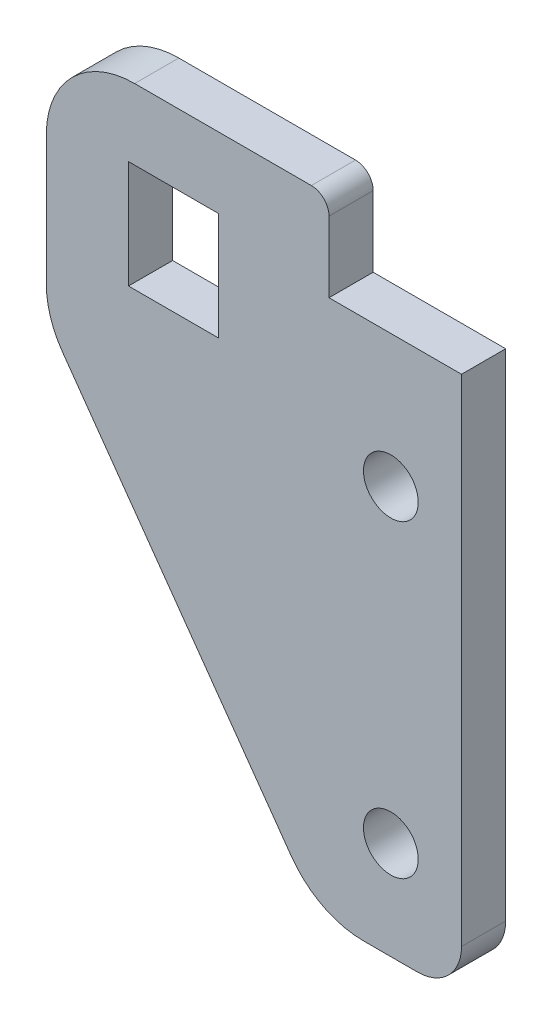
ISO-10303-21;
HEADER;
FILE_DESCRIPTION(('STEP AP214'),'2;1');
FILE_NAME('part.step','',(''),(''),'','','');
FILE_SCHEMA(('AUTOMOTIVE_DESIGN { 1 0 10303 214 1 1 1 1 }'));
ENDSEC;
DATA;
#1=APPLICATION_CONTEXT('core data for automotive mechanical design processes');
#2=APPLICATION_PROTOCOL_DEFINITION('international standard','automotive_design',2000,#1);
#3=PRODUCT_CONTEXT('',#1,'mechanical');
#4=PRODUCT('Part','Part','',(#3));
#5=PRODUCT_RELATED_PRODUCT_CATEGORY('part','',(#4));
#6=PRODUCT_DEFINITION_FORMATION('','',#4);
#7=PRODUCT_DEFINITION_CONTEXT('part definition',#1,'design');
#8=PRODUCT_DEFINITION('design','',#6,#7);
#9=PRODUCT_DEFINITION_SHAPE('','',#8);
#10=(LENGTH_UNIT() NAMED_UNIT(*) SI_UNIT(.MILLI.,.METRE.));
#11=(NAMED_UNIT(*) PLANE_ANGLE_UNIT() SI_UNIT($,.RADIAN.));
#12=(NAMED_UNIT(*) SI_UNIT($,.STERADIAN.) SOLID_ANGLE_UNIT());
#13=UNCERTAINTY_MEASURE_WITH_UNIT(LENGTH_MEASURE(1.E-05),#10,'distance_accuracy_value','');
#14=(GEOMETRIC_REPRESENTATION_CONTEXT(3) GLOBAL_UNCERTAINTY_ASSIGNED_CONTEXT((#13)) GLOBAL_UNIT_ASSIGNED_CONTEXT((#10,
#11,#12)) REPRESENTATION_CONTEXT('',''));
#15=CARTESIAN_POINT('',(0.,0.,0.));
#16=DIRECTION('',(0.,0.,1.));
#17=DIRECTION('',(1.,0.,0.));
#18=AXIS2_PLACEMENT_3D('',#15,#16,#17);
#19=CARTESIAN_POINT('',(0.,-77.1,5.));
#20=DIRECTION('',(0.,1.,0.));
#21=DIRECTION('',(0.,0.,1.));
#22=AXIS2_PLACEMENT_3D('',#19,#20,#21);
#23=PLANE('',#22);
#24=DIRECTION('',(1.,0.,0.));
#25=VECTOR('',#24,1.);
#26=CARTESIAN_POINT('',(0.,-77.1,0.));
#27=LINE('',#26,#25);
#28=CARTESIAN_POINT('',(-33.1025337448538,-77.1,0.));
#29=VERTEX_POINT('',#28);
#30=CARTESIAN_POINT('',(-27.,-77.1,0.));
#31=VERTEX_POINT('',#30);
#32=EDGE_CURVE('E267',#29,#31,#27,.T.);
#33=ORIENTED_EDGE('',*,*,#32,.T.);
#34=DIRECTION('',(0.,0.,-1.));
#35=VECTOR('',#34,1.);
#36=CARTESIAN_POINT('',(-27.,-77.1,5.));
#37=LINE('',#36,#35);
#38=CARTESIAN_POINT('',(-27.,-77.1,5.));
#39=VERTEX_POINT('',#38);
#40=EDGE_CURVE('E202',#31,#39,#37,.F.);
#41=ORIENTED_EDGE('',*,*,#40,.T.);
#42=DIRECTION('',(1.,0.,0.));
#43=VECTOR('',#42,1.);
#44=CARTESIAN_POINT('',(0.,-77.1,5.));
#45=LINE('',#44,#43);
#46=CARTESIAN_POINT('',(-33.1025337448538,-77.1,5.));
#47=VERTEX_POINT('',#46);
#48=EDGE_CURVE('E371',#47,#39,#45,.T.);
#49=ORIENTED_EDGE('',*,*,#48,.F.);
#50=DIRECTION('',(0.,0.,-1.));
#51=VECTOR('',#50,1.);
#52=CARTESIAN_POINT('',(-33.1025337448538,-77.1,5.));
#53=LINE('',#52,#51);
#54=EDGE_CURVE('E199',#47,#29,#53,.T.);
#55=ORIENTED_EDGE('',*,*,#54,.T.);
#56=EDGE_LOOP('',(#33,#41,#49,#55));
#57=FACE_BOUND('',#56,.T.);
#58=ADVANCED_FACE('F38',(#57),#23,.F.);
#59=CARTESIAN_POINT('',(-22.,0.,5.));
#60=DIRECTION('',(-1.,0.,0.));
#61=DIRECTION('',(0.,0.,1.));
#62=AXIS2_PLACEMENT_3D('',#59,#60,#61);
#63=PLANE('',#62);
#64=DIRECTION('',(0.,1.,0.));
#65=VECTOR('',#64,1.);
#66=CARTESIAN_POINT('',(-22.,0.,5.));
#67=LINE('',#66,#65);
#68=CARTESIAN_POINT('',(-22.,-72.1,5.));
#69=VERTEX_POINT('',#68);
#70=CARTESIAN_POINT('',(-22.,-16.,5.));
#71=VERTEX_POINT('',#70);
#72=EDGE_CURVE('E365',#69,#71,#67,.T.);
#73=ORIENTED_EDGE('',*,*,#72,.F.);
#74=DIRECTION('',(0.,0.,-1.));
#75=VECTOR('',#74,1.);
#76=CARTESIAN_POINT('',(-22.,-72.1,5.));
#77=LINE('',#76,#75);
#78=CARTESIAN_POINT('',(-22.,-72.1,0.));
#79=VERTEX_POINT('',#78);
#80=EDGE_CURVE('E186',#69,#79,#77,.T.);
#81=ORIENTED_EDGE('',*,*,#80,.T.);
#82=DIRECTION('',(0.,1.,0.));
#83=VECTOR('',#82,1.);
#84=CARTESIAN_POINT('',(-22.,0.,0.));
#85=LINE('',#84,#83);
#86=CARTESIAN_POINT('',(-22.,-16.,0.));
#87=VERTEX_POINT('',#86);
#88=EDGE_CURVE('E270',#79,#87,#85,.T.);
#89=ORIENTED_EDGE('',*,*,#88,.T.);
#90=DIRECTION('',(0.,0.,-1.));
#91=VECTOR('',#90,1.);
#92=CARTESIAN_POINT('',(-22.,-16.,5.));
#93=LINE('',#92,#91);
#94=EDGE_CURVE('E180',#71,#87,#93,.T.);
#95=ORIENTED_EDGE('',*,*,#94,.F.);
#96=EDGE_LOOP('',(#73,#81,#89,#95));
#97=FACE_BOUND('',#96,.T.);
#98=ADVANCED_FACE('F329',(#97),#63,.F.);
#99=CARTESIAN_POINT('',(0.,-16.,5.));
#100=DIRECTION('',(0.,-1.,0.));
#101=DIRECTION('',(1.,0.,0.));
#102=AXIS2_PLACEMENT_3D('',#99,#100,#101);
#103=PLANE('',#102);
#104=DIRECTION('',(-1.,0.,0.));
#105=VECTOR('',#104,1.);
#106=CARTESIAN_POINT('',(0.,-16.,0.));
#107=LINE('',#106,#105);
#108=CARTESIAN_POINT('',(-37.,-16.,0.));
#109=VERTEX_POINT('',#108);
#110=EDGE_CURVE('E275',#87,#109,#107,.T.);
#111=ORIENTED_EDGE('',*,*,#110,.T.);
#112=DIRECTION('',(0.,0.,-1.));
#113=VECTOR('',#112,1.);
#114=CARTESIAN_POINT('',(-37.,-16.,5.));
#115=LINE('',#114,#113);
#116=CARTESIAN_POINT('',(-37.,-16.,5.));
#117=VERTEX_POINT('',#116);
#118=EDGE_CURVE('E177',#117,#109,#115,.T.);
#119=ORIENTED_EDGE('',*,*,#118,.F.);
#120=DIRECTION('',(-1.,0.,0.));
#121=VECTOR('',#120,1.);
#122=CARTESIAN_POINT('',(0.,-16.,5.));
#123=LINE('',#122,#121);
#124=EDGE_CURVE('E299',#71,#117,#123,.T.);
#125=ORIENTED_EDGE('',*,*,#124,.F.);
#126=ORIENTED_EDGE('',*,*,#94,.T.);
#127=EDGE_LOOP('',(#111,#119,#125,#126));
#128=FACE_BOUND('',#127,.T.);
#129=ADVANCED_FACE('F335',(#128),#103,.F.);
#130=CARTESIAN_POINT('',(-37.,-1.04083408558608E-13,5.));
#131=DIRECTION('',(-1.,0.,0.));
#132=DIRECTION('',(0.,-1.,0.));
#133=AXIS2_PLACEMENT_3D('',#130,#131,#132);
#134=PLANE('',#133);
#135=DIRECTION('',(0.,1.,0.));
#136=VECTOR('',#135,1.);
#137=CARTESIAN_POINT('',(-37.,-1.04083408558608E-13,0.));
#138=LINE('',#137,#136);
#139=CARTESIAN_POINT('',(-37.,-8.00000000000001,0.));
#140=VERTEX_POINT('',#139);
#141=EDGE_CURVE('E246',#109,#140,#138,.T.);
#142=ORIENTED_EDGE('',*,*,#141,.T.);
#143=DIRECTION('',(0.,0.,-1.));
#144=VECTOR('',#143,1.);
#145=CARTESIAN_POINT('',(-37.,-8.00000000000001,5.));
#146=LINE('',#145,#144);
#147=CARTESIAN_POINT('',(-37.,-8.00000000000001,5.));
#148=VERTEX_POINT('',#147);
#149=EDGE_CURVE('E218',#140,#148,#146,.F.);
#150=ORIENTED_EDGE('',*,*,#149,.T.);
#151=DIRECTION('',(0.,1.,0.));
#152=VECTOR('',#151,1.);
#153=CARTESIAN_POINT('',(-37.,-1.04083408558608E-13,5.));
#154=LINE('',#153,#152);
#155=EDGE_CURVE('E293',#117,#148,#154,.T.);
#156=ORIENTED_EDGE('',*,*,#155,.F.);
#157=ORIENTED_EDGE('',*,*,#118,.T.);
#158=EDGE_LOOP('',(#142,#150,#156,#157));
#159=FACE_BOUND('',#158,.T.);
#160=ADVANCED_FACE('F280',(#159),#134,.F.);
#161=CARTESIAN_POINT('',(0.,-6.00000000000001,5.));
#162=DIRECTION('',(0.,-1.,0.));
#163=DIRECTION('',(1.,0.,0.));
#164=AXIS2_PLACEMENT_3D('',#161,#162,#163);
#165=PLANE('',#164);
#166=DIRECTION('',(-1.,0.,0.));
#167=VECTOR('',#166,1.);
#168=CARTESIAN_POINT('',(0.,-6.00000000000001,5.));
#169=LINE('',#168,#167);
#170=CARTESIAN_POINT('',(-39.,-6.00000000000001,5.));
#171=VERTEX_POINT('',#170);
#172=CARTESIAN_POINT('',(-59.,-6.00000000000001,5.));
#173=VERTEX_POINT('',#172);
#174=EDGE_CURVE('E292',#171,#173,#169,.T.);
#175=ORIENTED_EDGE('',*,*,#174,.F.);
#176=DIRECTION('',(0.,0.,-1.));
#177=VECTOR('',#176,1.);
#178=CARTESIAN_POINT('',(-39.,-6.00000000000001,5.));
#179=LINE('',#178,#177);
#180=CARTESIAN_POINT('',(-39.,-6.00000000000001,0.));
#181=VERTEX_POINT('',#180);
#182=EDGE_CURVE('E215',#171,#181,#179,.T.);
#183=ORIENTED_EDGE('',*,*,#182,.T.);
#184=DIRECTION('',(-1.,0.,0.));
#185=VECTOR('',#184,1.);
#186=CARTESIAN_POINT('',(0.,-6.00000000000001,0.));
#187=LINE('',#186,#185);
#188=CARTESIAN_POINT('',(-59.,-6.00000000000001,0.));
#189=VERTEX_POINT('',#188);
#190=EDGE_CURVE('E242',#181,#189,#187,.T.);
#191=ORIENTED_EDGE('',*,*,#190,.T.);
#192=DIRECTION('',(0.,0.,-1.));
#193=VECTOR('',#192,1.);
#194=CARTESIAN_POINT('',(-59.,-6.00000000000001,5.));
#195=LINE('',#194,#193);
#196=EDGE_CURVE('E213',#189,#173,#195,.F.);
#197=ORIENTED_EDGE('',*,*,#196,.T.);
#198=EDGE_LOOP('',(#175,#183,#191,#197));
#199=FACE_BOUND('',#198,.T.);
#200=ADVANCED_FACE('F295',(#199),#165,.F.);
#201=CARTESIAN_POINT('',(-69.,0.,5.));
#202=DIRECTION('',(-1.,0.,0.));
#203=DIRECTION('',(0.,-1.,0.));
#204=AXIS2_PLACEMENT_3D('',#201,#202,#203);
#205=PLANE('',#204);
#206=DIRECTION('',(0.,1.,0.));
#207=VECTOR('',#206,1.);
#208=CARTESIAN_POINT('',(-69.,0.,0.));
#209=LINE('',#208,#207);
#210=CARTESIAN_POINT('',(-69.,-30.6392985884291,0.));
#211=VERTEX_POINT('',#210);
#212=CARTESIAN_POINT('',(-69.,-16.,0.));
#213=VERTEX_POINT('',#212);
#214=EDGE_CURVE('E230',#211,#213,#209,.T.);
#215=ORIENTED_EDGE('',*,*,#214,.F.);
#216=DIRECTION('',(0.,0.,-1.));
#217=VECTOR('',#216,1.);
#218=CARTESIAN_POINT('',(-69.,-30.6392985884291,5.));
#219=LINE('',#218,#217);
#220=CARTESIAN_POINT('',(-69.,-30.6392985884291,5.));
#221=VERTEX_POINT('',#220);
#222=EDGE_CURVE('E12',#211,#221,#219,.F.);
#223=ORIENTED_EDGE('',*,*,#222,.T.);
#224=DIRECTION('',(0.,1.,0.));
#225=VECTOR('',#224,1.);
#226=CARTESIAN_POINT('',(-69.,0.,5.));
#227=LINE('',#226,#225);
#228=CARTESIAN_POINT('',(-69.,-16.,5.));
#229=VERTEX_POINT('',#228);
#230=EDGE_CURVE('E232',#221,#229,#227,.T.);
#231=ORIENTED_EDGE('',*,*,#230,.T.);
#232=DIRECTION('',(0.,0.,-1.));
#233=VECTOR('',#232,1.);
#234=CARTESIAN_POINT('',(-69.,-16.,0.));
#235=LINE('',#234,#233);
#236=EDGE_CURVE('E46',#229,#213,#235,.T.);
#237=ORIENTED_EDGE('',*,*,#236,.T.);
#238=EDGE_LOOP('',(#215,#223,#231,#237));
#239=FACE_BOUND('',#238,.T.);
#240=ADVANCED_FACE('F229',(#239),#205,.T.);
#241=CARTESIAN_POINT('',(0.,-14.,5.));
#242=DIRECTION('',(0.,1.,0.));
#243=DIRECTION('',(0.,0.,1.));
#244=AXIS2_PLACEMENT_3D('',#241,#242,#243);
#245=PLANE('',#244);
#246=DIRECTION('',(1.,0.,0.));
#247=VECTOR('',#246,1.);
#248=CARTESIAN_POINT('',(0.,-14.,0.));
#249=LINE('',#248,#247);
#250=CARTESIAN_POINT('',(-59.7,-14.,0.));
#251=VERTEX_POINT('',#250);
#252=CARTESIAN_POINT('',(-49.5,-14.,0.));
#253=VERTEX_POINT('',#252);
#254=EDGE_CURVE('E176',#251,#253,#249,.T.);
#255=ORIENTED_EDGE('',*,*,#254,.T.);
#256=DIRECTION('',(0.,0.,-1.));
#257=VECTOR('',#256,1.);
#258=CARTESIAN_POINT('',(-49.5,-14.,5.));
#259=LINE('',#258,#257);
#260=CARTESIAN_POINT('',(-49.5,-14.,5.));
#261=VERTEX_POINT('',#260);
#262=EDGE_CURVE('E157',#261,#253,#259,.T.);
#263=ORIENTED_EDGE('',*,*,#262,.F.);
#264=DIRECTION('',(1.,0.,0.));
#265=VECTOR('',#264,1.);
#266=CARTESIAN_POINT('',(0.,-14.,5.));
#267=LINE('',#266,#265);
#268=CARTESIAN_POINT('',(-59.7,-14.,5.));
#269=VERTEX_POINT('',#268);
#270=EDGE_CURVE('E164',#269,#261,#267,.T.);
#271=ORIENTED_EDGE('',*,*,#270,.F.);
#272=DIRECTION('',(0.,0.,-1.));
#273=VECTOR('',#272,1.);
#274=CARTESIAN_POINT('',(-59.7,-14.,5.));
#275=LINE('',#274,#273);
#276=EDGE_CURVE('E252',#269,#251,#275,.T.);
#277=ORIENTED_EDGE('',*,*,#276,.T.);
#278=EDGE_LOOP('',(#255,#263,#271,#277));
#279=FACE_BOUND('',#278,.T.);
#280=ADVANCED_FACE('F174',(#279),#245,.F.);
#281=CARTESIAN_POINT('',(-49.5,0.,5.));
#282=DIRECTION('',(1.,0.,0.));
#283=DIRECTION('',(0.,0.,-1.));
#284=AXIS2_PLACEMENT_3D('',#281,#282,#283);
#285=PLANE('',#284);
#286=DIRECTION('',(0.,-1.,0.));
#287=VECTOR('',#286,1.);
#288=CARTESIAN_POINT('',(-49.5,0.,0.));
#289=LINE('',#288,#287);
#290=CARTESIAN_POINT('',(-49.5,-26.2,0.));
#291=VERTEX_POINT('',#290);
#292=EDGE_CURVE('E265',#253,#291,#289,.T.);
#293=ORIENTED_EDGE('',*,*,#292,.T.);
#294=DIRECTION('',(0.,0.,-1.));
#295=VECTOR('',#294,1.);
#296=CARTESIAN_POINT('',(-49.5,-26.2,5.));
#297=LINE('',#296,#295);
#298=CARTESIAN_POINT('',(-49.5,-26.2,5.));
#299=VERTEX_POINT('',#298);
#300=EDGE_CURVE('E159',#299,#291,#297,.T.);
#301=ORIENTED_EDGE('',*,*,#300,.F.);
#302=DIRECTION('',(0.,-1.,0.));
#303=VECTOR('',#302,1.);
#304=CARTESIAN_POINT('',(-49.5,0.,5.));
#305=LINE('',#304,#303);
#306=EDGE_CURVE('E152',#261,#299,#305,.T.);
#307=ORIENTED_EDGE('',*,*,#306,.F.);
#308=ORIENTED_EDGE('',*,*,#262,.T.);
#309=EDGE_LOOP('',(#293,#301,#307,#308));
#310=FACE_BOUND('',#309,.T.);
#311=ADVANCED_FACE('F155',(#310),#285,.F.);
#312=CARTESIAN_POINT('',(0.,-26.2,5.));
#313=DIRECTION('',(0.,1.,0.));
#314=DIRECTION('',(0.,0.,1.));
#315=AXIS2_PLACEMENT_3D('',#312,#313,#314);
#316=PLANE('',#315);
#317=DIRECTION('',(1.,0.,0.));
#318=VECTOR('',#317,1.);
#319=CARTESIAN_POINT('',(0.,-26.2,0.));
#320=LINE('',#319,#318);
#321=CARTESIAN_POINT('',(-59.7,-26.2,0.));
#322=VERTEX_POINT('',#321);
#323=EDGE_CURVE('E262',#322,#291,#320,.T.);
#324=ORIENTED_EDGE('',*,*,#323,.F.);
#325=DIRECTION('',(0.,0.,-1.));
#326=VECTOR('',#325,1.);
#327=CARTESIAN_POINT('',(-59.7,-26.2,5.));
#328=LINE('',#327,#326);
#329=CARTESIAN_POINT('',(-59.7,-26.2,5.));
#330=VERTEX_POINT('',#329);
#331=EDGE_CURVE('E182',#330,#322,#328,.T.);
#332=ORIENTED_EDGE('',*,*,#331,.F.);
#333=DIRECTION('',(1.,0.,0.));
#334=VECTOR('',#333,1.);
#335=CARTESIAN_POINT('',(0.,-26.2,5.));
#336=LINE('',#335,#334);
#337=EDGE_CURVE('E163',#330,#299,#336,.T.);
#338=ORIENTED_EDGE('',*,*,#337,.T.);
#339=ORIENTED_EDGE('',*,*,#300,.T.);
#340=EDGE_LOOP('',(#324,#332,#338,#339));
#341=FACE_BOUND('',#340,.T.);
#342=ADVANCED_FACE('F263',(#341),#316,.T.);
#343=CARTESIAN_POINT('',(-59.7,0.,5.));
#344=DIRECTION('',(1.,0.,0.));
#345=DIRECTION('',(0.,0.,-1.));
#346=AXIS2_PLACEMENT_3D('',#343,#344,#345);
#347=PLANE('',#346);
#348=DIRECTION('',(0.,-1.,0.));
#349=VECTOR('',#348,1.);
#350=CARTESIAN_POINT('',(-59.7,0.,0.));
#351=LINE('',#350,#349);
#352=EDGE_CURVE('E259',#251,#322,#351,.T.);
#353=ORIENTED_EDGE('',*,*,#352,.F.);
#354=ORIENTED_EDGE('',*,*,#276,.F.);
#355=DIRECTION('',(0.,-1.,0.));
#356=VECTOR('',#355,1.);
#357=CARTESIAN_POINT('',(-59.7,0.,5.));
#358=LINE('',#357,#356);
#359=EDGE_CURVE('E170',#269,#330,#358,.T.);
#360=ORIENTED_EDGE('',*,*,#359,.T.);
#361=ORIENTED_EDGE('',*,*,#331,.T.);
#362=EDGE_LOOP('',(#353,#354,#360,#361));
#363=FACE_BOUND('',#362,.T.);
#364=ADVANCED_FACE('F257',(#363),#347,.T.);
#365=CARTESIAN_POINT('',(-30.,-31.,5.));
#366=DIRECTION('',(0.,0.,-1.));
#367=DIRECTION('',(-1.,0.,0.));
#368=AXIS2_PLACEMENT_3D('',#365,#366,#367);
#369=CYLINDRICAL_SURFACE('',#368,3.1);
#370=CARTESIAN_POINT('',(-30.,-31.,5.));
#371=DIRECTION('',(0.,0.,1.));
#372=DIRECTION('',(1.,0.,0.));
#373=AXIS2_PLACEMENT_3D('',#370,#371,#372);
#374=CIRCLE('',#373,3.1);
#375=CARTESIAN_POINT('',(-26.9,-31.,5.));
#376=VERTEX_POINT('',#375);
#377=EDGE_CURVE('E172',#376,#376,#374,.T.);
#378=ORIENTED_EDGE('',*,*,#377,.T.);
#379=EDGE_LOOP('',(#378));
#380=FACE_BOUND('',#379,.T.);
#381=CARTESIAN_POINT('',(-30.,-31.,0.));
#382=DIRECTION('',(0.,0.,1.));
#383=DIRECTION('',(1.,0.,0.));
#384=AXIS2_PLACEMENT_3D('',#381,#382,#383);
#385=CIRCLE('',#384,3.1);
#386=CARTESIAN_POINT('',(-26.9,-31.,0.));
#387=VERTEX_POINT('',#386);
#388=EDGE_CURVE('E307',#387,#387,#385,.T.);
#389=ORIENTED_EDGE('',*,*,#388,.F.);
#390=EDGE_LOOP('',(#389));
#391=FACE_BOUND('',#390,.T.);
#392=ADVANCED_FACE('F313',(#380,#391),#369,.F.);
#393=CARTESIAN_POINT('',(-30.,-66.,5.));
#394=DIRECTION('',(0.,0.,-1.));
#395=DIRECTION('',(-1.,0.,0.));
#396=AXIS2_PLACEMENT_3D('',#393,#394,#395);
#397=CYLINDRICAL_SURFACE('',#396,3.1);
#398=CARTESIAN_POINT('',(-30.,-66.,5.));
#399=DIRECTION('',(0.,0.,1.));
#400=DIRECTION('',(1.,0.,0.));
#401=AXIS2_PLACEMENT_3D('',#398,#399,#400);
#402=CIRCLE('',#401,3.1);
#403=CARTESIAN_POINT('',(-26.9,-66.,5.));
#404=VERTEX_POINT('',#403);
#405=EDGE_CURVE('E244',#404,#404,#402,.T.);
#406=ORIENTED_EDGE('',*,*,#405,.T.);
#407=EDGE_LOOP('',(#406));
#408=FACE_BOUND('',#407,.T.);
#409=CARTESIAN_POINT('',(-30.,-66.,0.));
#410=DIRECTION('',(0.,0.,1.));
#411=DIRECTION('',(1.,0.,0.));
#412=AXIS2_PLACEMENT_3D('',#409,#410,#411);
#413=CIRCLE('',#412,3.1);
#414=CARTESIAN_POINT('',(-26.9,-66.,0.));
#415=VERTEX_POINT('',#414);
#416=EDGE_CURVE('E304',#415,#415,#413,.T.);
#417=ORIENTED_EDGE('',*,*,#416,.F.);
#418=EDGE_LOOP('',(#417));
#419=FACE_BOUND('',#418,.T.);
#420=ADVANCED_FACE('F315',(#408,#419),#397,.F.);
#421=CARTESIAN_POINT('',(-61.8332978888302,-43.9192249058654,5.));
#422=DIRECTION('',(0.815273532707354,0.57907604584102,0.));
#423=DIRECTION('',(-0.57907604584102,0.815273532707354,0.));
#424=AXIS2_PLACEMENT_3D('',#421,#422,#423);
#425=PLANE('',#424);
#426=DIRECTION('',(0.57907604584102,-0.815273532707354,0.));
#427=VECTOR('',#426,1.);
#428=CARTESIAN_POINT('',(-61.8332978888302,-43.9192249058654,0.));
#429=LINE('',#428,#427);
#430=CARTESIAN_POINT('',(-67.1527353270735,-36.4300590468393,0.));
#431=VERTEX_POINT('',#430);
#432=CARTESIAN_POINT('',(-41.2552690719273,-72.8907604584102,0.));
#433=VERTEX_POINT('',#432);
#434=EDGE_CURVE('E241',#431,#433,#429,.T.);
#435=ORIENTED_EDGE('',*,*,#434,.T.);
#436=DIRECTION('',(0.,0.,-1.));
#437=VECTOR('',#436,1.);
#438=CARTESIAN_POINT('',(-41.2552690719273,-72.8907604584102,5.));
#439=LINE('',#438,#437);
#440=CARTESIAN_POINT('',(-41.2552690719273,-72.8907604584102,5.));
#441=VERTEX_POINT('',#440);
#442=EDGE_CURVE('E53',#433,#441,#439,.F.);
#443=ORIENTED_EDGE('',*,*,#442,.T.);
#444=DIRECTION('',(0.57907604584102,-0.815273532707354,0.));
#445=VECTOR('',#444,1.);
#446=CARTESIAN_POINT('',(-61.8332978888302,-43.9192249058654,5.));
#447=LINE('',#446,#445);
#448=CARTESIAN_POINT('',(-67.1527353270735,-36.4300590468393,5.));
#449=VERTEX_POINT('',#448);
#450=EDGE_CURVE('E253',#449,#441,#447,.T.);
#451=ORIENTED_EDGE('',*,*,#450,.F.);
#452=DIRECTION('',(0.,0.,-1.));
#453=VECTOR('',#452,1.);
#454=CARTESIAN_POINT('',(-67.1527353270735,-36.4300590468393,0.));
#455=LINE('',#454,#453);
#456=EDGE_CURVE('E220',#449,#431,#455,.T.);
#457=ORIENTED_EDGE('',*,*,#456,.T.);
#458=EDGE_LOOP('',(#435,#443,#451,#457));
#459=FACE_BOUND('',#458,.T.);
#460=ADVANCED_FACE('F322',(#459),#425,.F.);
#461=CARTESIAN_POINT('',(0.,0.,5.));
#462=DIRECTION('',(0.,0.,1.));
#463=DIRECTION('',(1.,0.,0.));
#464=AXIS2_PLACEMENT_3D('',#461,#462,#463);
#465=PLANE('',#464);
#466=ORIENTED_EDGE('',*,*,#405,.F.);
#467=EDGE_LOOP('',(#466));
#468=FACE_BOUND('',#467,.T.);
#469=ORIENTED_EDGE('',*,*,#377,.F.);
#470=EDGE_LOOP('',(#469));
#471=FACE_BOUND('',#470,.T.);
#472=ORIENTED_EDGE('',*,*,#270,.T.);
#473=ORIENTED_EDGE('',*,*,#306,.T.);
#474=ORIENTED_EDGE('',*,*,#337,.F.);
#475=ORIENTED_EDGE('',*,*,#359,.F.);
#476=EDGE_LOOP('',(#472,#473,#474,#475));
#477=FACE_BOUND('',#476,.T.);
#478=ORIENTED_EDGE('',*,*,#48,.T.);
#479=CARTESIAN_POINT('',(-27.,-72.1,5.));
#480=DIRECTION('',(0.,0.,1.));
#481=DIRECTION('',(1.,0.,0.));
#482=AXIS2_PLACEMENT_3D('',#479,#480,#481);
#483=CIRCLE('',#482,5.);
#484=EDGE_CURVE('E211',#39,#69,#483,.T.);
#485=ORIENTED_EDGE('',*,*,#484,.T.);
#486=ORIENTED_EDGE('',*,*,#72,.T.);
#487=ORIENTED_EDGE('',*,*,#124,.T.);
#488=ORIENTED_EDGE('',*,*,#155,.T.);
#489=CARTESIAN_POINT('',(-39.,-8.00000000000001,5.));
#490=DIRECTION('',(0.,0.,1.));
#491=DIRECTION('',(1.,0.,0.));
#492=AXIS2_PLACEMENT_3D('',#489,#490,#491);
#493=CIRCLE('',#492,2.);
#494=EDGE_CURVE('E209',#148,#171,#493,.T.);
#495=ORIENTED_EDGE('',*,*,#494,.T.);
#496=ORIENTED_EDGE('',*,*,#174,.T.);
#497=CARTESIAN_POINT('',(-59.,-16.,5.));
#498=DIRECTION('',(0.,0.,1.));
#499=DIRECTION('',(1.,0.,0.));
#500=AXIS2_PLACEMENT_3D('',#497,#498,#499);
#501=CIRCLE('',#500,10.);
#502=EDGE_CURVE('E204',#173,#229,#501,.T.);
#503=ORIENTED_EDGE('',*,*,#502,.T.);
#504=ORIENTED_EDGE('',*,*,#230,.F.);
#505=CARTESIAN_POINT('',(-59.,-30.6392985884291,5.));
#506=DIRECTION('',(0.,0.,1.));
#507=DIRECTION('',(1.,0.,0.));
#508=AXIS2_PLACEMENT_3D('',#505,#506,#507);
#509=CIRCLE('',#508,10.);
#510=EDGE_CURVE('E60',#221,#449,#509,.T.);
#511=ORIENTED_EDGE('',*,*,#510,.T.);
#512=ORIENTED_EDGE('',*,*,#450,.T.);
#513=CARTESIAN_POINT('',(-33.1025337448538,-67.1,5.));
#514=DIRECTION('',(0.,0.,1.));
#515=DIRECTION('',(1.,0.,0.));
#516=AXIS2_PLACEMENT_3D('',#513,#514,#515);
#517=CIRCLE('',#516,10.);
#518=EDGE_CURVE('E207',#441,#47,#517,.T.);
#519=ORIENTED_EDGE('',*,*,#518,.T.);
#520=EDGE_LOOP('',(#478,#485,#486,#487,#488,#495,#496,#503,#504,#511,#512,#519));
#521=FACE_BOUND('',#520,.T.);
#522=ADVANCED_FACE('F168',(#468,#471,#477,#521),#465,.T.);
#523=CARTESIAN_POINT('',(0.,0.,0.));
#524=DIRECTION('',(0.,0.,1.));
#525=DIRECTION('',(1.,0.,0.));
#526=AXIS2_PLACEMENT_3D('',#523,#524,#525);
#527=PLANE('',#526);
#528=ORIENTED_EDGE('',*,*,#416,.T.);
#529=EDGE_LOOP('',(#528));
#530=FACE_BOUND('',#529,.T.);
#531=ORIENTED_EDGE('',*,*,#388,.T.);
#532=EDGE_LOOP('',(#531));
#533=FACE_BOUND('',#532,.T.);
#534=ORIENTED_EDGE('',*,*,#254,.F.);
#535=ORIENTED_EDGE('',*,*,#352,.T.);
#536=ORIENTED_EDGE('',*,*,#323,.T.);
#537=ORIENTED_EDGE('',*,*,#292,.F.);
#538=EDGE_LOOP('',(#534,#535,#536,#537));
#539=FACE_BOUND('',#538,.T.);
#540=ORIENTED_EDGE('',*,*,#88,.F.);
#541=CARTESIAN_POINT('',(-27.,-72.1,0.));
#542=DIRECTION('',(0.,0.,1.));
#543=DIRECTION('',(1.,0.,0.));
#544=AXIS2_PLACEMENT_3D('',#541,#542,#543);
#545=CIRCLE('',#544,5.);
#546=EDGE_CURVE('E197',#79,#31,#545,.F.);
#547=ORIENTED_EDGE('',*,*,#546,.T.);
#548=ORIENTED_EDGE('',*,*,#32,.F.);
#549=CARTESIAN_POINT('',(-33.1025337448538,-67.1,0.));
#550=DIRECTION('',(0.,0.,1.));
#551=DIRECTION('',(1.,0.,0.));
#552=AXIS2_PLACEMENT_3D('',#549,#550,#551);
#553=CIRCLE('',#552,10.);
#554=EDGE_CURVE('E193',#29,#433,#553,.F.);
#555=ORIENTED_EDGE('',*,*,#554,.T.);
#556=ORIENTED_EDGE('',*,*,#434,.F.);
#557=CARTESIAN_POINT('',(-59.,-30.6392985884291,0.));
#558=DIRECTION('',(0.,0.,1.));
#559=DIRECTION('',(1.,0.,0.));
#560=AXIS2_PLACEMENT_3D('',#557,#558,#559);
#561=CIRCLE('',#560,10.);
#562=EDGE_CURVE('E191',#431,#211,#561,.F.);
#563=ORIENTED_EDGE('',*,*,#562,.T.);
#564=ORIENTED_EDGE('',*,*,#214,.T.);
#565=CARTESIAN_POINT('',(-59.,-16.,0.));
#566=DIRECTION('',(0.,0.,1.));
#567=DIRECTION('',(1.,0.,0.));
#568=AXIS2_PLACEMENT_3D('',#565,#566,#567);
#569=CIRCLE('',#568,10.);
#570=EDGE_CURVE('E189',#213,#189,#569,.F.);
#571=ORIENTED_EDGE('',*,*,#570,.T.);
#572=ORIENTED_EDGE('',*,*,#190,.F.);
#573=CARTESIAN_POINT('',(-39.,-8.00000000000001,0.));
#574=DIRECTION('',(0.,0.,1.));
#575=DIRECTION('',(1.,0.,0.));
#576=AXIS2_PLACEMENT_3D('',#573,#574,#575);
#577=CIRCLE('',#576,2.);
#578=EDGE_CURVE('E195',#181,#140,#577,.F.);
#579=ORIENTED_EDGE('',*,*,#578,.T.);
#580=ORIENTED_EDGE('',*,*,#141,.F.);
#581=ORIENTED_EDGE('',*,*,#110,.F.);
#582=EDGE_LOOP('',(#540,#547,#548,#555,#556,#563,#564,#571,#572,#579,#580,#581));
#583=FACE_BOUND('',#582,.T.);
#584=ADVANCED_FACE('F237',(#530,#533,#539,#583),#527,.F.);
#585=CARTESIAN_POINT('',(-27.,-72.1,5.));
#586=DIRECTION('',(0.,0.,-1.));
#587=DIRECTION('',(-1.,0.,0.));
#588=AXIS2_PLACEMENT_3D('',#585,#586,#587);
#589=CYLINDRICAL_SURFACE('',#588,5.);
#590=ORIENTED_EDGE('',*,*,#484,.F.);
#591=ORIENTED_EDGE('',*,*,#40,.F.);
#592=ORIENTED_EDGE('',*,*,#546,.F.);
#593=ORIENTED_EDGE('',*,*,#80,.F.);
#594=EDGE_LOOP('',(#590,#591,#592,#593));
#595=FACE_BOUND('',#594,.T.);
#596=ADVANCED_FACE('F368',(#595),#589,.T.);
#597=CARTESIAN_POINT('',(-39.,-8.00000000000001,5.));
#598=DIRECTION('',(0.,0.,-1.));
#599=DIRECTION('',(-1.,0.,0.));
#600=AXIS2_PLACEMENT_3D('',#597,#598,#599);
#601=CYLINDRICAL_SURFACE('',#600,2.);
#602=ORIENTED_EDGE('',*,*,#494,.F.);
#603=ORIENTED_EDGE('',*,*,#149,.F.);
#604=ORIENTED_EDGE('',*,*,#578,.F.);
#605=ORIENTED_EDGE('',*,*,#182,.F.);
#606=EDGE_LOOP('',(#602,#603,#604,#605));
#607=FACE_BOUND('',#606,.T.);
#608=ADVANCED_FACE('F287',(#607),#601,.T.);
#609=CARTESIAN_POINT('',(-33.1025337448538,-67.1,5.));
#610=DIRECTION('',(0.,0.,-1.));
#611=DIRECTION('',(-1.,0.,0.));
#612=AXIS2_PLACEMENT_3D('',#609,#610,#611);
#613=CYLINDRICAL_SURFACE('',#612,10.);
#614=ORIENTED_EDGE('',*,*,#518,.F.);
#615=ORIENTED_EDGE('',*,*,#442,.F.);
#616=ORIENTED_EDGE('',*,*,#554,.F.);
#617=ORIENTED_EDGE('',*,*,#54,.F.);
#618=EDGE_LOOP('',(#614,#615,#616,#617));
#619=FACE_BOUND('',#618,.T.);
#620=ADVANCED_FACE('F397',(#619),#613,.T.);
#621=CARTESIAN_POINT('',(-59.,-30.6392985884291,5.));
#622=DIRECTION('',(0.,0.,1.));
#623=DIRECTION('',(1.,0.,0.));
#624=AXIS2_PLACEMENT_3D('',#621,#622,#623);
#625=CYLINDRICAL_SURFACE('',#624,10.);
#626=ORIENTED_EDGE('',*,*,#510,.F.);
#627=ORIENTED_EDGE('',*,*,#222,.F.);
#628=ORIENTED_EDGE('',*,*,#562,.F.);
#629=ORIENTED_EDGE('',*,*,#456,.F.);
#630=EDGE_LOOP('',(#626,#627,#628,#629));
#631=FACE_BOUND('',#630,.T.);
#632=ADVANCED_FACE('F399',(#631),#625,.T.);
#633=CARTESIAN_POINT('',(-59.,-16.,5.));
#634=DIRECTION('',(0.,0.,1.));
#635=DIRECTION('',(1.,0.,0.));
#636=AXIS2_PLACEMENT_3D('',#633,#634,#635);
#637=CYLINDRICAL_SURFACE('',#636,10.);
#638=ORIENTED_EDGE('',*,*,#502,.F.);
#639=ORIENTED_EDGE('',*,*,#196,.F.);
#640=ORIENTED_EDGE('',*,*,#570,.F.);
#641=ORIENTED_EDGE('',*,*,#236,.F.);
#642=EDGE_LOOP('',(#638,#639,#640,#641));
#643=FACE_BOUND('',#642,.T.);
#644=ADVANCED_FACE('F40',(#643),#637,.T.);
#645=CLOSED_SHELL('',(#58,#98,#129,#160,#200,#240,#280,#311,#342,#364,#392,#420,#460,#522,#584,
#596,#608,#620,#632,#644));
#646=MANIFOLD_SOLID_BREP('B2',#645);
#647=ADVANCED_BREP_SHAPE_REPRESENTATION('',(#18,#646),#14);
#648=SHAPE_DEFINITION_REPRESENTATION(#9,#647);
ENDSEC;
END-ISO-10303-21;
